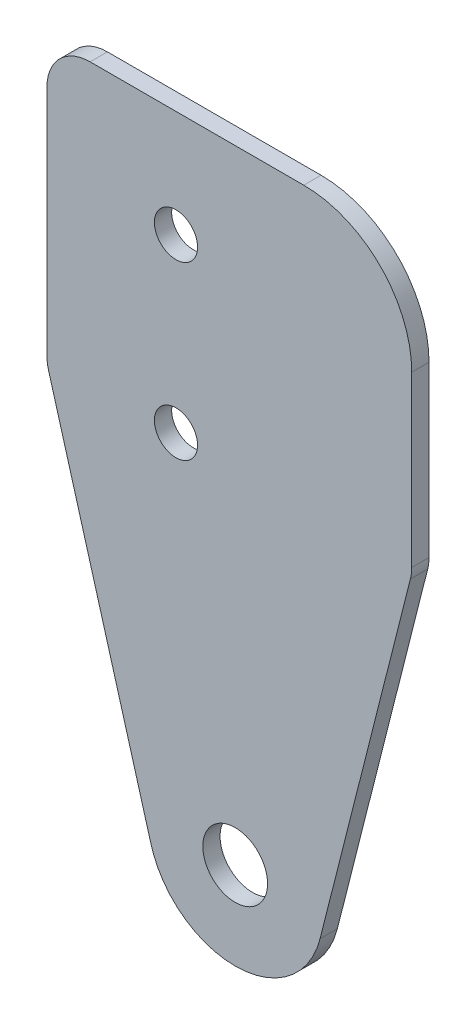
ISO-10303-21;
HEADER;
FILE_DESCRIPTION(('STEP AP214'),'2;1');
FILE_NAME('part.step','',(''),(''),'','','');
FILE_SCHEMA(('AUTOMOTIVE_DESIGN { 1 0 10303 214 1 1 1 1 }'));
ENDSEC;
DATA;
#1=APPLICATION_CONTEXT('core data for automotive mechanical design processes');
#2=APPLICATION_PROTOCOL_DEFINITION('international standard','automotive_design',2000,#1);
#3=PRODUCT_CONTEXT('',#1,'mechanical');
#4=PRODUCT('Part','Part','',(#3));
#5=PRODUCT_RELATED_PRODUCT_CATEGORY('part','',(#4));
#6=PRODUCT_DEFINITION_FORMATION('','',#4);
#7=PRODUCT_DEFINITION_CONTEXT('part definition',#1,'design');
#8=PRODUCT_DEFINITION('design','',#6,#7);
#9=PRODUCT_DEFINITION_SHAPE('','',#8);
#10=(LENGTH_UNIT() NAMED_UNIT(*) SI_UNIT(.MILLI.,.METRE.));
#11=(NAMED_UNIT(*) PLANE_ANGLE_UNIT() SI_UNIT($,.RADIAN.));
#12=(NAMED_UNIT(*) SI_UNIT($,.STERADIAN.) SOLID_ANGLE_UNIT());
#13=UNCERTAINTY_MEASURE_WITH_UNIT(LENGTH_MEASURE(1.E-05),#10,'distance_accuracy_value','');
#14=(GEOMETRIC_REPRESENTATION_CONTEXT(3) GLOBAL_UNCERTAINTY_ASSIGNED_CONTEXT((#13)) GLOBAL_UNIT_ASSIGNED_CONTEXT((#10,
#11,#12)) REPRESENTATION_CONTEXT('',''));
#15=CARTESIAN_POINT('',(0.,0.,0.));
#16=DIRECTION('',(0.,0.,1.));
#17=DIRECTION('',(1.,0.,0.));
#18=AXIS2_PLACEMENT_3D('',#15,#16,#17);
#19=CARTESIAN_POINT('',(280.129035475283,81.6760158720647,0.8));
#20=DIRECTION('',(0.,0.,-1.));
#21=DIRECTION('',(-1.,0.,0.));
#22=AXIS2_PLACEMENT_3D('',#19,#20,#21);
#23=PLANE('',#22);
#24=CARTESIAN_POINT('',(280.129035475283,81.6760158720647,0.8));
#25=DIRECTION('',(0.,0.,1.));
#26=DIRECTION('',(-1.,0.,0.));
#27=AXIS2_PLACEMENT_3D('',#24,#25,#26);
#28=CIRCLE('',#27,4.05483010831053);
#29=CARTESIAN_POINT('',(276.199648246891,80.6752345689775,0.8));
#30=VERTEX_POINT('',#29);
#31=CARTESIAN_POINT('',(284.059750770805,80.680463526474,0.8));
#32=VERTEX_POINT('',#31);
#33=EDGE_CURVE('E182',#30,#32,#28,.T.);
#34=ORIENTED_EDGE('',*,*,#33,.T.);
#35=DIRECTION('',(0.245522578997895,0.969390872250313,0.));
#36=VECTOR('',#35,1.);
#37=CARTESIAN_POINT('',(288.244841789054,97.2043573743875,0.8));
#38=LINE('',#37,#36);
#39=CARTESIAN_POINT('',(288.244841789054,97.2043573743875,0.8));
#40=VERTEX_POINT('',#39);
#41=EDGE_CURVE('E106',#32,#40,#38,.T.);
#42=ORIENTED_EDGE('',*,*,#41,.T.);
#43=CARTESIAN_POINT('',(286.306060044553,97.6954025323833,0.8));
#44=DIRECTION('',(0.,0.,1.));
#45=DIRECTION('',(1.,0.,0.));
#46=AXIS2_PLACEMENT_3D('',#43,#44,#45);
#47=CIRCLE('',#46,2.);
#48=CARTESIAN_POINT('',(288.306060044553,97.6954025323833,0.8));
#49=VERTEX_POINT('',#48);
#50=EDGE_CURVE('E211',#40,#49,#47,.T.);
#51=ORIENTED_EDGE('',*,*,#50,.T.);
#52=DIRECTION('',(0.,1.,0.));
#53=VECTOR('',#52,1.);
#54=CARTESIAN_POINT('',(288.306060044553,105.528768710248,0.8));
#55=LINE('',#54,#53);
#56=CARTESIAN_POINT('',(288.306060044553,105.528768710248,0.8));
#57=VERTEX_POINT('',#56);
#58=EDGE_CURVE('E231',#49,#57,#55,.T.);
#59=ORIENTED_EDGE('',*,*,#58,.T.);
#60=CARTESIAN_POINT('',(283.306060044553,105.528768710248,0.8));
#61=DIRECTION('',(0.,0.,1.));
#62=DIRECTION('',(1.,0.,0.));
#63=AXIS2_PLACEMENT_3D('',#60,#61,#62);
#64=CIRCLE('',#63,5.);
#65=CARTESIAN_POINT('',(283.306060044553,110.528768710248,0.8));
#66=VERTEX_POINT('',#65);
#67=EDGE_CURVE('E227',#57,#66,#64,.T.);
#68=ORIENTED_EDGE('',*,*,#67,.T.);
#69=DIRECTION('',(-1.,0.,0.));
#70=VECTOR('',#69,1.);
#71=CARTESIAN_POINT('',(273.4133070104,110.528768710248,0.8));
#72=LINE('',#71,#70);
#73=CARTESIAN_POINT('',(273.4133070104,110.528768710248,0.8));
#74=VERTEX_POINT('',#73);
#75=EDGE_CURVE('E230',#66,#74,#72,.T.);
#76=ORIENTED_EDGE('',*,*,#75,.T.);
#77=CARTESIAN_POINT('',(273.4133070104,108.528768710248,0.8));
#78=DIRECTION('',(0.,0.,1.));
#79=DIRECTION('',(1.,0.,0.));
#80=AXIS2_PLACEMENT_3D('',#77,#78,#79);
#81=CIRCLE('',#80,2.);
#82=CARTESIAN_POINT('',(271.4133070104,108.528768710248,0.8));
#83=VERTEX_POINT('',#82);
#84=EDGE_CURVE('E131',#74,#83,#81,.T.);
#85=ORIENTED_EDGE('',*,*,#84,.T.);
#86=DIRECTION('',(0.,-1.,0.));
#87=VECTOR('',#86,1.);
#88=CARTESIAN_POINT('',(271.4133070104,108.528768710248,0.8));
#89=LINE('',#88,#87);
#90=CARTESIAN_POINT('',(271.4133070104,97.7258745344683,0.8));
#91=VERTEX_POINT('',#90);
#92=EDGE_CURVE('E125',#83,#91,#89,.T.);
#93=ORIENTED_EDGE('',*,*,#92,.T.);
#94=CARTESIAN_POINT('',(273.4133070104,97.7258745344683,0.8));
#95=DIRECTION('',(0.,0.,1.));
#96=DIRECTION('',(-1.,0.,0.));
#97=AXIS2_PLACEMENT_3D('',#94,#95,#96);
#98=CIRCLE('',#97,1.99999999999998);
#99=CARTESIAN_POINT('',(271.490097915792,97.1769967899591,0.8));
#100=VERTEX_POINT('',#99);
#101=EDGE_CURVE('E129',#91,#100,#98,.T.);
#102=ORIENTED_EDGE('',*,*,#101,.T.);
#103=DIRECTION('',(0.274438872254678,-0.961604547303922,0.));
#104=VECTOR('',#103,1.);
#105=CARTESIAN_POINT('',(271.490097915792,97.1769967899591,0.8));
#106=LINE('',#105,#104);
#107=EDGE_CURVE('E57',#100,#30,#106,.T.);
#108=ORIENTED_EDGE('',*,*,#107,.T.);
#109=EDGE_LOOP('',(#34,#42,#51,#59,#68,#76,#85,#93,#102,#108));
#110=FACE_BOUND('',#109,.T.);
#111=CARTESIAN_POINT('',(280.129035475283,81.6760158720647,0.8));
#112=DIRECTION('',(0.,0.,1.));
#113=DIRECTION('',(1.,0.,0.));
#114=AXIS2_PLACEMENT_3D('',#111,#112,#113);
#115=CIRCLE('',#114,1.50000000000002);
#116=CARTESIAN_POINT('',(281.629035475283,81.6760158720647,0.8));
#117=VERTEX_POINT('',#116);
#118=EDGE_CURVE('E158',#117,#117,#115,.T.);
#119=ORIENTED_EDGE('',*,*,#118,.F.);
#120=EDGE_LOOP('',(#119));
#121=FACE_BOUND('',#120,.T.);
#122=CARTESIAN_POINT('',(277.387391499222,97.6389825010977,0.8));
#123=DIRECTION('',(0.,0.,1.));
#124=DIRECTION('',(1.,0.,0.));
#125=AXIS2_PLACEMENT_3D('',#122,#123,#124);
#126=CIRCLE('',#125,0.999999999999998);
#127=CARTESIAN_POINT('',(278.387391499222,97.6389825010977,0.8));
#128=VERTEX_POINT('',#127);
#129=EDGE_CURVE('E249',#128,#128,#126,.T.);
#130=ORIENTED_EDGE('',*,*,#129,.F.);
#131=EDGE_LOOP('',(#130));
#132=FACE_BOUND('',#131,.T.);
#133=CARTESIAN_POINT('',(277.387391499222,105.581442101852,0.8));
#134=DIRECTION('',(0.,0.,1.));
#135=DIRECTION('',(1.,0.,0.));
#136=AXIS2_PLACEMENT_3D('',#133,#134,#135);
#137=CIRCLE('',#136,0.999999999999998);
#138=CARTESIAN_POINT('',(278.387391499222,105.581442101852,0.8));
#139=VERTEX_POINT('',#138);
#140=EDGE_CURVE('E257',#139,#139,#137,.T.);
#141=ORIENTED_EDGE('',*,*,#140,.F.);
#142=EDGE_LOOP('',(#141));
#143=FACE_BOUND('',#142,.T.);
#144=ADVANCED_FACE('F39',(#110,#121,#132,#143),#23,.F.);
#145=CARTESIAN_POINT('',(280.129035475283,81.6760158720647,0.));
#146=DIRECTION('',(0.,0.,-1.));
#147=DIRECTION('',(-1.,0.,0.));
#148=AXIS2_PLACEMENT_3D('',#145,#146,#147);
#149=PLANE('',#148);
#150=CARTESIAN_POINT('',(277.387391499222,97.6389825010977,0.));
#151=DIRECTION('',(0.,0.,1.));
#152=DIRECTION('',(1.,0.,0.));
#153=AXIS2_PLACEMENT_3D('',#150,#151,#152);
#154=CIRCLE('',#153,0.999999999999998);
#155=CARTESIAN_POINT('',(278.387391499222,97.6389825010977,0.));
#156=VERTEX_POINT('',#155);
#157=EDGE_CURVE('E253',#156,#156,#154,.T.);
#158=ORIENTED_EDGE('',*,*,#157,.T.);
#159=EDGE_LOOP('',(#158));
#160=FACE_BOUND('',#159,.T.);
#161=CARTESIAN_POINT('',(280.129035475283,81.6760158720647,0.));
#162=DIRECTION('',(0.,0.,1.));
#163=DIRECTION('',(-1.,0.,0.));
#164=AXIS2_PLACEMENT_3D('',#161,#162,#163);
#165=CIRCLE('',#164,4.05483010831053);
#166=CARTESIAN_POINT('',(276.199648246891,80.6752345689775,0.));
#167=VERTEX_POINT('',#166);
#168=CARTESIAN_POINT('',(284.059750770805,80.680463526474,0.));
#169=VERTEX_POINT('',#168);
#170=EDGE_CURVE('E153',#167,#169,#165,.T.);
#171=ORIENTED_EDGE('',*,*,#170,.F.);
#172=DIRECTION('',(0.274438872254678,-0.961604547303922,0.));
#173=VECTOR('',#172,1.);
#174=CARTESIAN_POINT('',(271.490097915792,97.1769967899591,0.));
#175=LINE('',#174,#173);
#176=CARTESIAN_POINT('',(271.490097915792,97.1769967899591,0.));
#177=VERTEX_POINT('',#176);
#178=EDGE_CURVE('E98',#177,#167,#175,.T.);
#179=ORIENTED_EDGE('',*,*,#178,.F.);
#180=CARTESIAN_POINT('',(273.4133070104,97.7258745344683,0.));
#181=DIRECTION('',(0.,0.,1.));
#182=DIRECTION('',(-1.,0.,0.));
#183=AXIS2_PLACEMENT_3D('',#180,#181,#182);
#184=CIRCLE('',#183,1.99999999999998);
#185=CARTESIAN_POINT('',(271.4133070104,97.7258745344683,0.));
#186=VERTEX_POINT('',#185);
#187=EDGE_CURVE('E92',#186,#177,#184,.T.);
#188=ORIENTED_EDGE('',*,*,#187,.F.);
#189=DIRECTION('',(0.,-1.,0.));
#190=VECTOR('',#189,1.);
#191=CARTESIAN_POINT('',(271.4133070104,108.528768710248,0.));
#192=LINE('',#191,#190);
#193=CARTESIAN_POINT('',(271.4133070104,108.528768710248,0.));
#194=VERTEX_POINT('',#193);
#195=EDGE_CURVE('E140',#194,#186,#192,.T.);
#196=ORIENTED_EDGE('',*,*,#195,.F.);
#197=CARTESIAN_POINT('',(273.4133070104,108.528768710248,0.));
#198=DIRECTION('',(0.,0.,1.));
#199=DIRECTION('',(1.,0.,0.));
#200=AXIS2_PLACEMENT_3D('',#197,#198,#199);
#201=CIRCLE('',#200,2.);
#202=CARTESIAN_POINT('',(273.4133070104,110.528768710248,0.));
#203=VERTEX_POINT('',#202);
#204=EDGE_CURVE('E173',#203,#194,#201,.T.);
#205=ORIENTED_EDGE('',*,*,#204,.F.);
#206=DIRECTION('',(-1.,0.,0.));
#207=VECTOR('',#206,1.);
#208=CARTESIAN_POINT('',(273.4133070104,110.528768710248,0.));
#209=LINE('',#208,#207);
#210=CARTESIAN_POINT('',(283.306060044553,110.528768710248,0.));
#211=VERTEX_POINT('',#210);
#212=EDGE_CURVE('E170',#211,#203,#209,.T.);
#213=ORIENTED_EDGE('',*,*,#212,.F.);
#214=CARTESIAN_POINT('',(283.306060044553,105.528768710248,0.));
#215=DIRECTION('',(0.,0.,1.));
#216=DIRECTION('',(1.,0.,0.));
#217=AXIS2_PLACEMENT_3D('',#214,#215,#216);
#218=CIRCLE('',#217,5.);
#219=CARTESIAN_POINT('',(288.306060044553,105.528768710248,0.));
#220=VERTEX_POINT('',#219);
#221=EDGE_CURVE('E167',#220,#211,#218,.T.);
#222=ORIENTED_EDGE('',*,*,#221,.F.);
#223=DIRECTION('',(0.,1.,0.));
#224=VECTOR('',#223,1.);
#225=CARTESIAN_POINT('',(288.306060044553,105.528768710248,0.));
#226=LINE('',#225,#224);
#227=CARTESIAN_POINT('',(288.306060044553,97.6954025323833,0.));
#228=VERTEX_POINT('',#227);
#229=EDGE_CURVE('E164',#228,#220,#226,.T.);
#230=ORIENTED_EDGE('',*,*,#229,.F.);
#231=CARTESIAN_POINT('',(286.306060044553,97.6954025323833,0.));
#232=DIRECTION('',(0.,0.,1.));
#233=DIRECTION('',(1.,0.,0.));
#234=AXIS2_PLACEMENT_3D('',#231,#232,#233);
#235=CIRCLE('',#234,2.);
#236=CARTESIAN_POINT('',(288.244841789054,97.2043573743875,0.));
#237=VERTEX_POINT('',#236);
#238=EDGE_CURVE('E161',#237,#228,#235,.T.);
#239=ORIENTED_EDGE('',*,*,#238,.F.);
#240=DIRECTION('',(0.245522578997895,0.969390872250313,0.));
#241=VECTOR('',#240,1.);
#242=CARTESIAN_POINT('',(288.244841789054,97.2043573743875,0.));
#243=LINE('',#242,#241);
#244=EDGE_CURVE('E157',#169,#237,#243,.T.);
#245=ORIENTED_EDGE('',*,*,#244,.F.);
#246=EDGE_LOOP('',(#171,#179,#188,#196,#205,#213,#222,#230,#239,#245));
#247=FACE_BOUND('',#246,.T.);
#248=CARTESIAN_POINT('',(280.129035475283,81.6760158720647,0.));
#249=DIRECTION('',(0.,0.,1.));
#250=DIRECTION('',(1.,0.,0.));
#251=AXIS2_PLACEMENT_3D('',#248,#249,#250);
#252=CIRCLE('',#251,1.50000000000002);
#253=CARTESIAN_POINT('',(281.629035475283,81.6760158720647,0.));
#254=VERTEX_POINT('',#253);
#255=EDGE_CURVE('E245',#254,#254,#252,.T.);
#256=ORIENTED_EDGE('',*,*,#255,.T.);
#257=EDGE_LOOP('',(#256));
#258=FACE_BOUND('',#257,.T.);
#259=CARTESIAN_POINT('',(277.387391499222,105.581442101852,0.));
#260=DIRECTION('',(0.,0.,1.));
#261=DIRECTION('',(1.,0.,0.));
#262=AXIS2_PLACEMENT_3D('',#259,#260,#261);
#263=CIRCLE('',#262,0.999999999999998);
#264=CARTESIAN_POINT('',(278.387391499222,105.581442101852,0.));
#265=VERTEX_POINT('',#264);
#266=EDGE_CURVE('E261',#265,#265,#263,.T.);
#267=ORIENTED_EDGE('',*,*,#266,.T.);
#268=EDGE_LOOP('',(#267));
#269=FACE_BOUND('',#268,.T.);
#270=ADVANCED_FACE('F215',(#160,#247,#258,#269),#149,.T.);
#271=CARTESIAN_POINT('',(280.129035475283,81.6760158720647,0.8));
#272=DIRECTION('',(0.,0.,-1.));
#273=DIRECTION('',(-1.,0.,0.));
#274=AXIS2_PLACEMENT_3D('',#271,#272,#273);
#275=CYLINDRICAL_SURFACE('',#274,4.05483010831053);
#276=ORIENTED_EDGE('',*,*,#170,.T.);
#277=DIRECTION('',(0.,0.,-1.));
#278=VECTOR('',#277,1.);
#279=CARTESIAN_POINT('',(284.059750770805,80.680463526474,0.8));
#280=LINE('',#279,#278);
#281=EDGE_CURVE('E11',#32,#169,#280,.T.);
#282=ORIENTED_EDGE('',*,*,#281,.F.);
#283=ORIENTED_EDGE('',*,*,#33,.F.);
#284=DIRECTION('',(0.,0.,-1.));
#285=VECTOR('',#284,1.);
#286=CARTESIAN_POINT('',(276.199648246891,80.6752345689775,0.8));
#287=LINE('',#286,#285);
#288=EDGE_CURVE('E149',#30,#167,#287,.T.);
#289=ORIENTED_EDGE('',*,*,#288,.T.);
#290=EDGE_LOOP('',(#276,#282,#283,#289));
#291=FACE_BOUND('',#290,.T.);
#292=ADVANCED_FACE('F41',(#291),#275,.T.);
#293=CARTESIAN_POINT('',(288.244841789054,97.2043573743875,0.8));
#294=DIRECTION('',(-0.969390872250313,0.245522578997895,0.));
#295=DIRECTION('',(-0.245522578997895,-0.969390872250313,0.));
#296=AXIS2_PLACEMENT_3D('',#293,#294,#295);
#297=PLANE('',#296);
#298=ORIENTED_EDGE('',*,*,#244,.T.);
#299=DIRECTION('',(0.,0.,-1.));
#300=VECTOR('',#299,1.);
#301=CARTESIAN_POINT('',(288.244841789054,97.2043573743875,0.8));
#302=LINE('',#301,#300);
#303=EDGE_CURVE('E49',#40,#237,#302,.T.);
#304=ORIENTED_EDGE('',*,*,#303,.F.);
#305=ORIENTED_EDGE('',*,*,#41,.F.);
#306=ORIENTED_EDGE('',*,*,#281,.T.);
#307=EDGE_LOOP('',(#298,#304,#305,#306));
#308=FACE_BOUND('',#307,.T.);
#309=ADVANCED_FACE('F303',(#308),#297,.F.);
#310=CARTESIAN_POINT('',(286.306060044553,97.6954025323833,0.8));
#311=DIRECTION('',(0.,0.,-1.));
#312=DIRECTION('',(-1.,0.,0.));
#313=AXIS2_PLACEMENT_3D('',#310,#311,#312);
#314=CYLINDRICAL_SURFACE('',#313,2.);
#315=ORIENTED_EDGE('',*,*,#238,.T.);
#316=DIRECTION('',(0.,0.,-1.));
#317=VECTOR('',#316,1.);
#318=CARTESIAN_POINT('',(288.306060044553,97.6954025323833,0.8));
#319=LINE('',#318,#317);
#320=EDGE_CURVE('E201',#49,#228,#319,.T.);
#321=ORIENTED_EDGE('',*,*,#320,.F.);
#322=ORIENTED_EDGE('',*,*,#50,.F.);
#323=ORIENTED_EDGE('',*,*,#303,.T.);
#324=EDGE_LOOP('',(#315,#321,#322,#323));
#325=FACE_BOUND('',#324,.T.);
#326=ADVANCED_FACE('F209',(#325),#314,.T.);
#327=CARTESIAN_POINT('',(288.306060044553,105.528768710248,0.8));
#328=DIRECTION('',(-1.,0.,0.));
#329=DIRECTION('',(0.,0.,1.));
#330=AXIS2_PLACEMENT_3D('',#327,#328,#329);
#331=PLANE('',#330);
#332=ORIENTED_EDGE('',*,*,#229,.T.);
#333=DIRECTION('',(0.,0.,-1.));
#334=VECTOR('',#333,1.);
#335=CARTESIAN_POINT('',(288.306060044553,105.528768710248,0.8));
#336=LINE('',#335,#334);
#337=EDGE_CURVE('E197',#57,#220,#336,.T.);
#338=ORIENTED_EDGE('',*,*,#337,.F.);
#339=ORIENTED_EDGE('',*,*,#58,.F.);
#340=ORIENTED_EDGE('',*,*,#320,.T.);
#341=EDGE_LOOP('',(#332,#338,#339,#340));
#342=FACE_BOUND('',#341,.T.);
#343=ADVANCED_FACE('F221',(#342),#331,.F.);
#344=CARTESIAN_POINT('',(283.306060044553,105.528768710248,0.8));
#345=DIRECTION('',(0.,0.,-1.));
#346=DIRECTION('',(-1.,0.,0.));
#347=AXIS2_PLACEMENT_3D('',#344,#345,#346);
#348=CYLINDRICAL_SURFACE('',#347,5.);
#349=ORIENTED_EDGE('',*,*,#221,.T.);
#350=DIRECTION('',(0.,0.,-1.));
#351=VECTOR('',#350,1.);
#352=CARTESIAN_POINT('',(283.306060044553,110.528768710248,0.8));
#353=LINE('',#352,#351);
#354=EDGE_CURVE('E193',#66,#211,#353,.T.);
#355=ORIENTED_EDGE('',*,*,#354,.F.);
#356=ORIENTED_EDGE('',*,*,#67,.F.);
#357=ORIENTED_EDGE('',*,*,#337,.T.);
#358=EDGE_LOOP('',(#349,#355,#356,#357));
#359=FACE_BOUND('',#358,.T.);
#360=ADVANCED_FACE('F225',(#359),#348,.T.);
#361=CARTESIAN_POINT('',(273.4133070104,110.528768710248,0.8));
#362=DIRECTION('',(0.,-1.,0.));
#363=DIRECTION('',(0.,0.,-1.));
#364=AXIS2_PLACEMENT_3D('',#361,#362,#363);
#365=PLANE('',#364);
#366=ORIENTED_EDGE('',*,*,#212,.T.);
#367=DIRECTION('',(0.,0.,-1.));
#368=VECTOR('',#367,1.);
#369=CARTESIAN_POINT('',(273.4133070104,110.528768710248,0.8));
#370=LINE('',#369,#368);
#371=EDGE_CURVE('E189',#74,#203,#370,.T.);
#372=ORIENTED_EDGE('',*,*,#371,.F.);
#373=ORIENTED_EDGE('',*,*,#75,.F.);
#374=ORIENTED_EDGE('',*,*,#354,.T.);
#375=EDGE_LOOP('',(#366,#372,#373,#374));
#376=FACE_BOUND('',#375,.T.);
#377=ADVANCED_FACE('F293',(#376),#365,.F.);
#378=CARTESIAN_POINT('',(273.4133070104,108.528768710248,0.8));
#379=DIRECTION('',(0.,0.,-1.));
#380=DIRECTION('',(-1.,0.,0.));
#381=AXIS2_PLACEMENT_3D('',#378,#379,#380);
#382=CYLINDRICAL_SURFACE('',#381,2.);
#383=ORIENTED_EDGE('',*,*,#204,.T.);
#384=DIRECTION('',(0.,0.,-1.));
#385=VECTOR('',#384,1.);
#386=CARTESIAN_POINT('',(271.4133070104,108.528768710248,0.8));
#387=LINE('',#386,#385);
#388=EDGE_CURVE('E142',#83,#194,#387,.T.);
#389=ORIENTED_EDGE('',*,*,#388,.F.);
#390=ORIENTED_EDGE('',*,*,#84,.F.);
#391=ORIENTED_EDGE('',*,*,#371,.T.);
#392=EDGE_LOOP('',(#383,#389,#390,#391));
#393=FACE_BOUND('',#392,.T.);
#394=ADVANCED_FACE('F290',(#393),#382,.T.);
#395=CARTESIAN_POINT('',(271.4133070104,108.528768710248,0.8));
#396=DIRECTION('',(1.,0.,0.));
#397=DIRECTION('',(0.,0.,-1.));
#398=AXIS2_PLACEMENT_3D('',#395,#396,#397);
#399=PLANE('',#398);
#400=ORIENTED_EDGE('',*,*,#195,.T.);
#401=DIRECTION('',(0.,0.,-1.));
#402=VECTOR('',#401,1.);
#403=CARTESIAN_POINT('',(271.4133070104,97.7258745344683,0.8));
#404=LINE('',#403,#402);
#405=EDGE_CURVE('E137',#91,#186,#404,.T.);
#406=ORIENTED_EDGE('',*,*,#405,.F.);
#407=ORIENTED_EDGE('',*,*,#92,.F.);
#408=ORIENTED_EDGE('',*,*,#388,.T.);
#409=EDGE_LOOP('',(#400,#406,#407,#408));
#410=FACE_BOUND('',#409,.T.);
#411=ADVANCED_FACE('F138',(#410),#399,.F.);
#412=CARTESIAN_POINT('',(273.4133070104,97.7258745344683,0.8));
#413=DIRECTION('',(0.,0.,-1.));
#414=DIRECTION('',(-1.,0.,0.));
#415=AXIS2_PLACEMENT_3D('',#412,#413,#414);
#416=CYLINDRICAL_SURFACE('',#415,1.99999999999998);
#417=ORIENTED_EDGE('',*,*,#187,.T.);
#418=DIRECTION('',(0.,0.,-1.));
#419=VECTOR('',#418,1.);
#420=CARTESIAN_POINT('',(271.490097915792,97.1769967899591,0.8));
#421=LINE('',#420,#419);
#422=EDGE_CURVE('E143',#100,#177,#421,.T.);
#423=ORIENTED_EDGE('',*,*,#422,.F.);
#424=ORIENTED_EDGE('',*,*,#101,.F.);
#425=ORIENTED_EDGE('',*,*,#405,.T.);
#426=EDGE_LOOP('',(#417,#423,#424,#425));
#427=FACE_BOUND('',#426,.T.);
#428=ADVANCED_FACE('F145',(#427),#416,.T.);
#429=CARTESIAN_POINT('',(271.490097915792,97.1769967899591,0.8));
#430=DIRECTION('',(0.961604547303922,0.274438872254678,0.));
#431=DIRECTION('',(-0.274438872254678,0.961604547303922,0.));
#432=AXIS2_PLACEMENT_3D('',#429,#430,#431);
#433=PLANE('',#432);
#434=ORIENTED_EDGE('',*,*,#178,.T.);
#435=ORIENTED_EDGE('',*,*,#288,.F.);
#436=ORIENTED_EDGE('',*,*,#107,.F.);
#437=ORIENTED_EDGE('',*,*,#422,.T.);
#438=EDGE_LOOP('',(#434,#435,#436,#437));
#439=FACE_BOUND('',#438,.T.);
#440=ADVANCED_FACE('F283',(#439),#433,.F.);
#441=CARTESIAN_POINT('',(280.129035475283,81.6760158720647,0.8));
#442=DIRECTION('',(0.,0.,-1.));
#443=DIRECTION('',(-1.,0.,0.));
#444=AXIS2_PLACEMENT_3D('',#441,#442,#443);
#445=CYLINDRICAL_SURFACE('',#444,1.50000000000002);
#446=ORIENTED_EDGE('',*,*,#118,.T.);
#447=EDGE_LOOP('',(#446));
#448=FACE_BOUND('',#447,.T.);
#449=ORIENTED_EDGE('',*,*,#255,.F.);
#450=EDGE_LOOP('',(#449));
#451=FACE_BOUND('',#450,.T.);
#452=ADVANCED_FACE('F280',(#448,#451),#445,.F.);
#453=CARTESIAN_POINT('',(277.387391499222,97.6389825010977,0.8));
#454=DIRECTION('',(0.,0.,-1.));
#455=DIRECTION('',(-1.,0.,0.));
#456=AXIS2_PLACEMENT_3D('',#453,#454,#455);
#457=CYLINDRICAL_SURFACE('',#456,0.999999999999998);
#458=ORIENTED_EDGE('',*,*,#129,.T.);
#459=EDGE_LOOP('',(#458));
#460=FACE_BOUND('',#459,.T.);
#461=ORIENTED_EDGE('',*,*,#157,.F.);
#462=EDGE_LOOP('',(#461));
#463=FACE_BOUND('',#462,.T.);
#464=ADVANCED_FACE('F379',(#460,#463),#457,.F.);
#465=CARTESIAN_POINT('',(277.387391499222,105.581442101852,0.8));
#466=DIRECTION('',(0.,0.,-1.));
#467=DIRECTION('',(-1.,0.,0.));
#468=AXIS2_PLACEMENT_3D('',#465,#466,#467);
#469=CYLINDRICAL_SURFACE('',#468,0.999999999999998);
#470=ORIENTED_EDGE('',*,*,#140,.T.);
#471=EDGE_LOOP('',(#470));
#472=FACE_BOUND('',#471,.T.);
#473=ORIENTED_EDGE('',*,*,#266,.F.);
#474=EDGE_LOOP('',(#473));
#475=FACE_BOUND('',#474,.T.);
#476=ADVANCED_FACE('F269',(#472,#475),#469,.F.);
#477=CLOSED_SHELL('',(#144,#270,#292,#309,#326,#343,#360,#377,#394,#411,#428,#440,#452,#464,#476));
#478=MANIFOLD_SOLID_BREP('B2',#477);
#479=ADVANCED_BREP_SHAPE_REPRESENTATION('',(#18,#478),#14);
#480=SHAPE_DEFINITION_REPRESENTATION(#9,#479);
ENDSEC;
END-ISO-10303-21;
